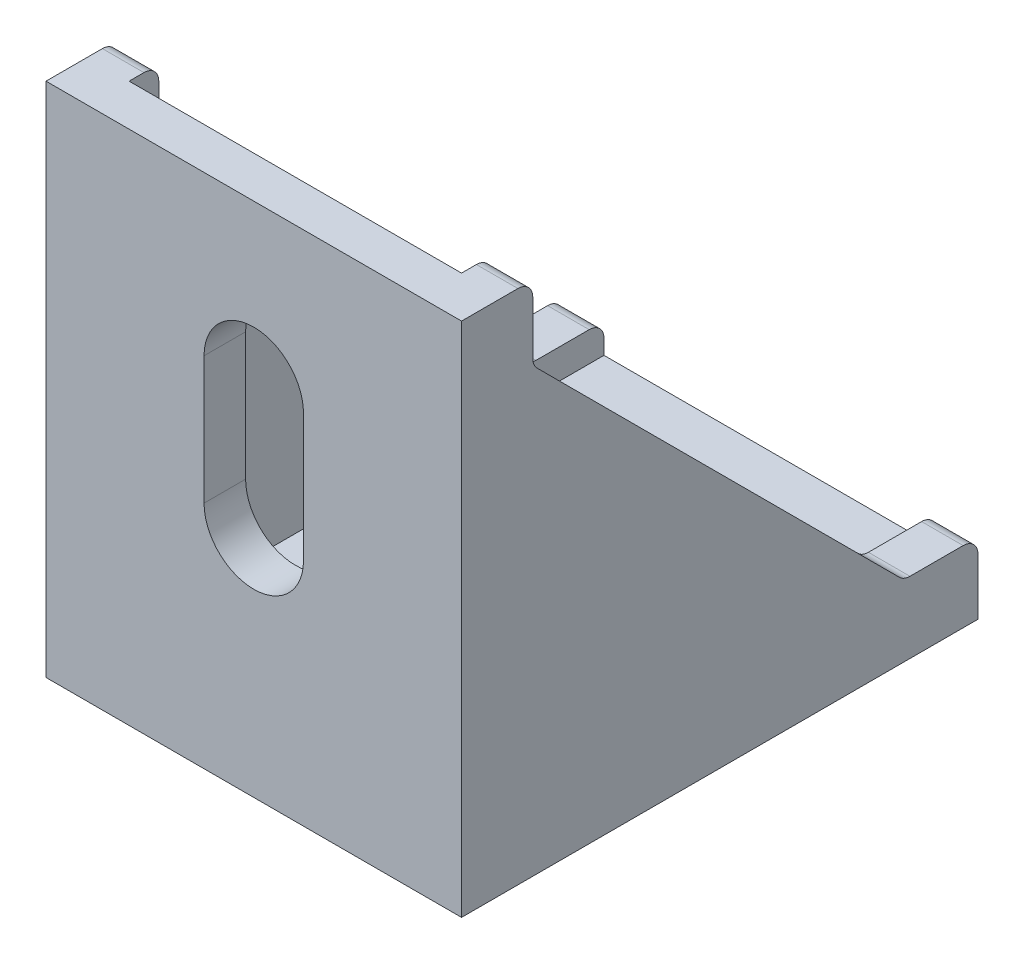
ISO-10303-21;
HEADER;
FILE_DESCRIPTION(('STEP AP214'),'2;1');
FILE_NAME('part.step','',(''),(''),'','','');
FILE_SCHEMA(('AUTOMOTIVE_DESIGN { 1 0 10303 214 1 1 1 1 }'));
ENDSEC;
DATA;
#1=APPLICATION_CONTEXT('core data for automotive mechanical design processes');
#2=APPLICATION_PROTOCOL_DEFINITION('international standard','automotive_design',2000,#1);
#3=PRODUCT_CONTEXT('',#1,'mechanical');
#4=PRODUCT('Part','Part','',(#3));
#5=PRODUCT_RELATED_PRODUCT_CATEGORY('part','',(#4));
#6=PRODUCT_DEFINITION_FORMATION('','',#4);
#7=PRODUCT_DEFINITION_CONTEXT('part definition',#1,'design');
#8=PRODUCT_DEFINITION('design','',#6,#7);
#9=PRODUCT_DEFINITION_SHAPE('','',#8);
#10=(LENGTH_UNIT() NAMED_UNIT(*) SI_UNIT(.MILLI.,.METRE.));
#11=(NAMED_UNIT(*) PLANE_ANGLE_UNIT() SI_UNIT($,.RADIAN.));
#12=(NAMED_UNIT(*) SI_UNIT($,.STERADIAN.) SOLID_ANGLE_UNIT());
#13=UNCERTAINTY_MEASURE_WITH_UNIT(LENGTH_MEASURE(1.E-05),#10,'distance_accuracy_value','');
#14=(GEOMETRIC_REPRESENTATION_CONTEXT(3) GLOBAL_UNCERTAINTY_ASSIGNED_CONTEXT((#13)) GLOBAL_UNIT_ASSIGNED_CONTEXT((#10,
#11,#12)) REPRESENTATION_CONTEXT('',''));
#15=CARTESIAN_POINT('',(0.,0.,0.));
#16=DIRECTION('',(0.,0.,1.));
#17=DIRECTION('',(1.,0.,0.));
#18=AXIS2_PLACEMENT_3D('',#15,#16,#17);
#19=CARTESIAN_POINT('',(-14.,34.8,-2.8));
#20=DIRECTION('',(0.,1.,0.));
#21=DIRECTION('',(0.,0.,1.));
#22=AXIS2_PLACEMENT_3D('',#19,#20,#21);
#23=PLANE('',#22);
#24=DIRECTION('',(0.,0.,1.));
#25=VECTOR('',#24,1.);
#26=CARTESIAN_POINT('',(-11.2,34.8,-2.8));
#27=LINE('',#26,#25);
#28=CARTESIAN_POINT('',(-11.2,34.8,-3.8));
#29=VERTEX_POINT('',#28);
#30=CARTESIAN_POINT('',(-11.2,34.8,-2.8));
#31=VERTEX_POINT('',#30);
#32=EDGE_CURVE('E302',#29,#31,#27,.T.);
#33=ORIENTED_EDGE('',*,*,#32,.F.);
#34=DIRECTION('',(-1.,0.,0.));
#35=VECTOR('',#34,1.);
#36=CARTESIAN_POINT('',(-14.,34.8,-3.8));
#37=LINE('',#36,#35);
#38=CARTESIAN_POINT('',(-14.,34.8,-3.8));
#39=VERTEX_POINT('',#38);
#40=EDGE_CURVE('E445',#29,#39,#37,.T.);
#41=ORIENTED_EDGE('',*,*,#40,.T.);
#42=DIRECTION('',(0.,0.,1.));
#43=VECTOR('',#42,1.);
#44=CARTESIAN_POINT('',(-14.,34.8,-2.8));
#45=LINE('',#44,#43);
#46=CARTESIAN_POINT('',(-14.,34.8,0.));
#47=VERTEX_POINT('',#46);
#48=EDGE_CURVE('E357',#39,#47,#45,.T.);
#49=ORIENTED_EDGE('',*,*,#48,.T.);
#50=DIRECTION('',(1.,0.,0.));
#51=VECTOR('',#50,1.);
#52=CARTESIAN_POINT('',(-14.,34.8,0.));
#53=LINE('',#52,#51);
#54=CARTESIAN_POINT('',(14.,34.8,0.));
#55=VERTEX_POINT('',#54);
#56=EDGE_CURVE('E369',#47,#55,#53,.T.);
#57=ORIENTED_EDGE('',*,*,#56,.T.);
#58=DIRECTION('',(0.,0.,1.));
#59=VECTOR('',#58,1.);
#60=CARTESIAN_POINT('',(14.,34.8,-2.8));
#61=LINE('',#60,#59);
#62=CARTESIAN_POINT('',(14.,34.8,-3.8));
#63=VERTEX_POINT('',#62);
#64=EDGE_CURVE('E349',#63,#55,#61,.T.);
#65=ORIENTED_EDGE('',*,*,#64,.F.);
#66=DIRECTION('',(1.,0.,0.));
#67=VECTOR('',#66,1.);
#68=CARTESIAN_POINT('',(-14.,34.8,-3.8));
#69=LINE('',#68,#67);
#70=CARTESIAN_POINT('',(11.2,34.8,-3.8));
#71=VERTEX_POINT('',#70);
#72=EDGE_CURVE('E443',#63,#71,#69,.F.);
#73=ORIENTED_EDGE('',*,*,#72,.T.);
#74=DIRECTION('',(0.,0.,1.));
#75=VECTOR('',#74,1.);
#76=CARTESIAN_POINT('',(11.2,34.8,-2.8));
#77=LINE('',#76,#75);
#78=CARTESIAN_POINT('',(11.2,34.8,-2.8));
#79=VERTEX_POINT('',#78);
#80=EDGE_CURVE('E347',#71,#79,#77,.T.);
#81=ORIENTED_EDGE('',*,*,#80,.T.);
#82=DIRECTION('',(1.,0.,0.));
#83=VECTOR('',#82,1.);
#84=CARTESIAN_POINT('',(-14.,34.8,-2.8));
#85=LINE('',#84,#83);
#86=EDGE_CURVE('E379',#31,#79,#85,.T.);
#87=ORIENTED_EDGE('',*,*,#86,.F.);
#88=EDGE_LOOP('',(#33,#41,#49,#57,#65,#73,#81,#87));
#89=FACE_BOUND('',#88,.T.);
#90=ADVANCED_FACE('F34',(#89),#23,.T.);
#91=CARTESIAN_POINT('',(-14.,2.8,-2.8));
#92=DIRECTION('',(0.,0.,-1.));
#93=DIRECTION('',(0.,1.,0.));
#94=AXIS2_PLACEMENT_3D('',#91,#92,#93);
#95=PLANE('',#94);
#96=CARTESIAN_POINT('',(0.,15.5,-2.8));
#97=DIRECTION('',(0.,0.,-1.));
#98=DIRECTION('',(0.,1.,0.));
#99=AXIS2_PLACEMENT_3D('',#96,#97,#98);
#100=CIRCLE('',#99,3.35);
#101=CARTESIAN_POINT('',(3.35,15.5,-2.8));
#102=VERTEX_POINT('',#101);
#103=CARTESIAN_POINT('',(-3.35,15.5,-2.8));
#104=VERTEX_POINT('',#103);
#105=EDGE_CURVE('E49',#102,#104,#100,.T.);
#106=ORIENTED_EDGE('',*,*,#105,.F.);
#107=DIRECTION('',(0.,-1.,0.));
#108=VECTOR('',#107,1.);
#109=CARTESIAN_POINT('',(3.35,15.5,-2.8));
#110=LINE('',#109,#108);
#111=CARTESIAN_POINT('',(3.35,24.1,-2.8));
#112=VERTEX_POINT('',#111);
#113=EDGE_CURVE('E248',#112,#102,#110,.T.);
#114=ORIENTED_EDGE('',*,*,#113,.F.);
#115=CARTESIAN_POINT('',(0.,24.1,-2.8));
#116=DIRECTION('',(0.,0.,-1.));
#117=DIRECTION('',(0.,1.,0.));
#118=AXIS2_PLACEMENT_3D('',#115,#116,#117);
#119=CIRCLE('',#118,3.35);
#120=CARTESIAN_POINT('',(-3.35,24.1,-2.8));
#121=VERTEX_POINT('',#120);
#122=EDGE_CURVE('E251',#121,#112,#119,.T.);
#123=ORIENTED_EDGE('',*,*,#122,.F.);
#124=DIRECTION('',(0.,1.,0.));
#125=VECTOR('',#124,1.);
#126=CARTESIAN_POINT('',(-3.35,15.5,-2.8));
#127=LINE('',#126,#125);
#128=EDGE_CURVE('E257',#104,#121,#127,.T.);
#129=ORIENTED_EDGE('',*,*,#128,.F.);
#130=EDGE_LOOP('',(#106,#114,#123,#129));
#131=FACE_BOUND('',#130,.T.);
#132=DIRECTION('',(0.,-1.,0.));
#133=VECTOR('',#132,1.);
#134=CARTESIAN_POINT('',(-11.2,2.8,-2.8));
#135=LINE('',#134,#133);
#136=CARTESIAN_POINT('',(-11.2,2.8,-2.8));
#137=VERTEX_POINT('',#136);
#138=EDGE_CURVE('E299',#31,#137,#135,.T.);
#139=ORIENTED_EDGE('',*,*,#138,.F.);
#140=ORIENTED_EDGE('',*,*,#86,.T.);
#141=DIRECTION('',(0.,-1.,0.));
#142=VECTOR('',#141,1.);
#143=CARTESIAN_POINT('',(11.2,2.8,-2.8));
#144=LINE('',#143,#142);
#145=CARTESIAN_POINT('',(11.2,2.8,-2.8));
#146=VERTEX_POINT('',#145);
#147=EDGE_CURVE('E328',#79,#146,#144,.T.);
#148=ORIENTED_EDGE('',*,*,#147,.T.);
#149=DIRECTION('',(1.,0.,0.));
#150=VECTOR('',#149,1.);
#151=CARTESIAN_POINT('',(-14.,2.8,-2.8));
#152=LINE('',#151,#150);
#153=EDGE_CURVE('E383',#137,#146,#152,.T.);
#154=ORIENTED_EDGE('',*,*,#153,.F.);
#155=EDGE_LOOP('',(#139,#140,#148,#154));
#156=FACE_BOUND('',#155,.T.);
#157=ADVANCED_FACE('F498',(#131,#156),#95,.T.);
#158=CARTESIAN_POINT('',(-14.,2.8,-34.8));
#159=DIRECTION('',(0.,1.,0.));
#160=DIRECTION('',(0.,0.,1.));
#161=AXIS2_PLACEMENT_3D('',#158,#159,#160);
#162=PLANE('',#161);
#163=CARTESIAN_POINT('',(0.,2.8,-15.5));
#164=DIRECTION('',(0.,1.,0.));
#165=DIRECTION('',(0.,0.,1.));
#166=AXIS2_PLACEMENT_3D('',#163,#164,#165);
#167=CIRCLE('',#166,3.35);
#168=CARTESIAN_POINT('',(-3.35,2.8,-15.5));
#169=VERTEX_POINT('',#168);
#170=CARTESIAN_POINT('',(3.35,2.8,-15.5));
#171=VERTEX_POINT('',#170);
#172=EDGE_CURVE('E263',#169,#171,#167,.T.);
#173=ORIENTED_EDGE('',*,*,#172,.F.);
#174=DIRECTION('',(0.,0.,1.));
#175=VECTOR('',#174,1.);
#176=CARTESIAN_POINT('',(-3.35,2.8,-15.5));
#177=LINE('',#176,#175);
#178=CARTESIAN_POINT('',(-3.35,2.8,-24.1));
#179=VERTEX_POINT('',#178);
#180=EDGE_CURVE('E271',#179,#169,#177,.T.);
#181=ORIENTED_EDGE('',*,*,#180,.F.);
#182=CARTESIAN_POINT('',(0.,2.8,-24.1));
#183=DIRECTION('',(0.,1.,0.));
#184=DIRECTION('',(0.,0.,1.));
#185=AXIS2_PLACEMENT_3D('',#182,#183,#184);
#186=CIRCLE('',#185,3.35);
#187=CARTESIAN_POINT('',(3.35,2.8,-24.1));
#188=VERTEX_POINT('',#187);
#189=EDGE_CURVE('E285',#188,#179,#186,.T.);
#190=ORIENTED_EDGE('',*,*,#189,.F.);
#191=DIRECTION('',(0.,0.,-1.));
#192=VECTOR('',#191,1.);
#193=CARTESIAN_POINT('',(3.35,2.8,-15.5));
#194=LINE('',#193,#192);
#195=EDGE_CURVE('E282',#171,#188,#194,.T.);
#196=ORIENTED_EDGE('',*,*,#195,.F.);
#197=EDGE_LOOP('',(#173,#181,#190,#196));
#198=FACE_BOUND('',#197,.T.);
#199=DIRECTION('',(0.,0.,-1.));
#200=VECTOR('',#199,1.);
#201=CARTESIAN_POINT('',(-11.2,2.8,-34.8));
#202=LINE('',#201,#200);
#203=CARTESIAN_POINT('',(-11.2,2.8,-34.8));
#204=VERTEX_POINT('',#203);
#205=EDGE_CURVE('E317',#137,#204,#202,.T.);
#206=ORIENTED_EDGE('',*,*,#205,.F.);
#207=ORIENTED_EDGE('',*,*,#153,.T.);
#208=DIRECTION('',(0.,0.,-1.));
#209=VECTOR('',#208,1.);
#210=CARTESIAN_POINT('',(11.2,2.8,-34.8));
#211=LINE('',#210,#209);
#212=CARTESIAN_POINT('',(11.2,2.8,-34.8));
#213=VERTEX_POINT('',#212);
#214=EDGE_CURVE('E331',#146,#213,#211,.T.);
#215=ORIENTED_EDGE('',*,*,#214,.T.);
#216=DIRECTION('',(1.,0.,0.));
#217=VECTOR('',#216,1.);
#218=CARTESIAN_POINT('',(-14.,2.8,-34.8));
#219=LINE('',#218,#217);
#220=EDGE_CURVE('E385',#204,#213,#219,.T.);
#221=ORIENTED_EDGE('',*,*,#220,.F.);
#222=EDGE_LOOP('',(#206,#207,#215,#221));
#223=FACE_BOUND('',#222,.T.);
#224=ADVANCED_FACE('F489',(#198,#223),#162,.T.);
#225=CARTESIAN_POINT('',(-14.,0.,-34.8));
#226=DIRECTION('',(0.,0.,-1.));
#227=DIRECTION('',(-1.,0.,0.));
#228=AXIS2_PLACEMENT_3D('',#225,#226,#227);
#229=PLANE('',#228);
#230=DIRECTION('',(0.,1.,0.));
#231=VECTOR('',#230,1.);
#232=CARTESIAN_POINT('',(11.2,4.8,-34.8));
#233=LINE('',#232,#231);
#234=CARTESIAN_POINT('',(11.2,3.8,-34.8));
#235=VERTEX_POINT('',#234);
#236=EDGE_CURVE('E335',#213,#235,#233,.T.);
#237=ORIENTED_EDGE('',*,*,#236,.T.);
#238=DIRECTION('',(1.,0.,0.));
#239=VECTOR('',#238,1.);
#240=CARTESIAN_POINT('',(-14.,3.8,-34.8));
#241=LINE('',#240,#239);
#242=CARTESIAN_POINT('',(14.,3.8,-34.8));
#243=VERTEX_POINT('',#242);
#244=EDGE_CURVE('E424',#235,#243,#241,.T.);
#245=ORIENTED_EDGE('',*,*,#244,.T.);
#246=DIRECTION('',(0.,1.,0.));
#247=VECTOR('',#246,1.);
#248=CARTESIAN_POINT('',(14.,0.,-34.8));
#249=LINE('',#248,#247);
#250=CARTESIAN_POINT('',(14.,0.,-34.8));
#251=VERTEX_POINT('',#250);
#252=EDGE_CURVE('E360',#251,#243,#249,.T.);
#253=ORIENTED_EDGE('',*,*,#252,.F.);
#254=DIRECTION('',(1.,0.,0.));
#255=VECTOR('',#254,1.);
#256=CARTESIAN_POINT('',(-14.,0.,-34.8));
#257=LINE('',#256,#255);
#258=CARTESIAN_POINT('',(-14.,0.,-34.8));
#259=VERTEX_POINT('',#258);
#260=EDGE_CURVE('E387',#259,#251,#257,.T.);
#261=ORIENTED_EDGE('',*,*,#260,.F.);
#262=DIRECTION('',(0.,1.,0.));
#263=VECTOR('',#262,1.);
#264=CARTESIAN_POINT('',(-14.,0.,-34.8));
#265=LINE('',#264,#263);
#266=CARTESIAN_POINT('',(-14.,3.8,-34.8));
#267=VERTEX_POINT('',#266);
#268=EDGE_CURVE('E366',#259,#267,#265,.T.);
#269=ORIENTED_EDGE('',*,*,#268,.T.);
#270=DIRECTION('',(-1.,0.,0.));
#271=VECTOR('',#270,1.);
#272=CARTESIAN_POINT('',(-11.2,3.8,-34.8));
#273=LINE('',#272,#271);
#274=CARTESIAN_POINT('',(-11.2,3.8,-34.8));
#275=VERTEX_POINT('',#274);
#276=EDGE_CURVE('E422',#267,#275,#273,.F.);
#277=ORIENTED_EDGE('',*,*,#276,.T.);
#278=DIRECTION('',(0.,1.,0.));
#279=VECTOR('',#278,1.);
#280=CARTESIAN_POINT('',(-11.2,4.8,-34.8));
#281=LINE('',#280,#279);
#282=EDGE_CURVE('E314',#204,#275,#281,.T.);
#283=ORIENTED_EDGE('',*,*,#282,.F.);
#284=ORIENTED_EDGE('',*,*,#220,.T.);
#285=EDGE_LOOP('',(#237,#245,#253,#261,#269,#277,#283,#284));
#286=FACE_BOUND('',#285,.T.);
#287=ADVANCED_FACE('F485',(#286),#229,.T.);
#288=CARTESIAN_POINT('',(-14.,0.,0.));
#289=DIRECTION('',(0.,-1.,0.));
#290=DIRECTION('',(0.,0.,-1.));
#291=AXIS2_PLACEMENT_3D('',#288,#289,#290);
#292=PLANE('',#291);
#293=CARTESIAN_POINT('',(0.,0.,-15.5));
#294=DIRECTION('',(0.,1.,0.));
#295=DIRECTION('',(0.,0.,1.));
#296=AXIS2_PLACEMENT_3D('',#293,#294,#295);
#297=CIRCLE('',#296,3.35);
#298=CARTESIAN_POINT('',(-3.35,0.,-15.5));
#299=VERTEX_POINT('',#298);
#300=CARTESIAN_POINT('',(3.35,0.,-15.5));
#301=VERTEX_POINT('',#300);
#302=EDGE_CURVE('E267',#299,#301,#297,.T.);
#303=ORIENTED_EDGE('',*,*,#302,.T.);
#304=DIRECTION('',(0.,0.,-1.));
#305=VECTOR('',#304,1.);
#306=CARTESIAN_POINT('',(3.35,0.,-15.5));
#307=LINE('',#306,#305);
#308=CARTESIAN_POINT('',(3.35,0.,-24.1));
#309=VERTEX_POINT('',#308);
#310=EDGE_CURVE('E270',#301,#309,#307,.T.);
#311=ORIENTED_EDGE('',*,*,#310,.T.);
#312=CARTESIAN_POINT('',(0.,0.,-24.1));
#313=DIRECTION('',(0.,1.,0.));
#314=DIRECTION('',(0.,0.,1.));
#315=AXIS2_PLACEMENT_3D('',#312,#313,#314);
#316=CIRCLE('',#315,3.35);
#317=CARTESIAN_POINT('',(-3.35,0.,-24.1));
#318=VERTEX_POINT('',#317);
#319=EDGE_CURVE('E274',#309,#318,#316,.T.);
#320=ORIENTED_EDGE('',*,*,#319,.T.);
#321=DIRECTION('',(0.,0.,1.));
#322=VECTOR('',#321,1.);
#323=CARTESIAN_POINT('',(-3.35,0.,-15.5));
#324=LINE('',#323,#322);
#325=EDGE_CURVE('E277',#318,#299,#324,.T.);
#326=ORIENTED_EDGE('',*,*,#325,.T.);
#327=EDGE_LOOP('',(#303,#311,#320,#326));
#328=FACE_BOUND('',#327,.T.);
#329=DIRECTION('',(0.,0.,-1.));
#330=VECTOR('',#329,1.);
#331=CARTESIAN_POINT('',(14.,0.,0.));
#332=LINE('',#331,#330);
#333=CARTESIAN_POINT('',(14.,0.,0.));
#334=VERTEX_POINT('',#333);
#335=EDGE_CURVE('E374',#334,#251,#332,.T.);
#336=ORIENTED_EDGE('',*,*,#335,.F.);
#337=DIRECTION('',(1.,0.,0.));
#338=VECTOR('',#337,1.);
#339=CARTESIAN_POINT('',(-14.,0.,0.));
#340=LINE('',#339,#338);
#341=CARTESIAN_POINT('',(-14.,0.,0.));
#342=VERTEX_POINT('',#341);
#343=EDGE_CURVE('E389',#342,#334,#340,.T.);
#344=ORIENTED_EDGE('',*,*,#343,.F.);
#345=DIRECTION('',(0.,0.,-1.));
#346=VECTOR('',#345,1.);
#347=CARTESIAN_POINT('',(-14.,0.,0.));
#348=LINE('',#347,#346);
#349=EDGE_CURVE('E363',#342,#259,#348,.T.);
#350=ORIENTED_EDGE('',*,*,#349,.T.);
#351=ORIENTED_EDGE('',*,*,#260,.T.);
#352=EDGE_LOOP('',(#336,#344,#350,#351));
#353=FACE_BOUND('',#352,.T.);
#354=ADVANCED_FACE('F539',(#328,#353),#292,.T.);
#355=CARTESIAN_POINT('',(-14.,34.8,0.));
#356=DIRECTION('',(0.,0.,1.));
#357=DIRECTION('',(0.,-1.,0.));
#358=AXIS2_PLACEMENT_3D('',#355,#356,#357);
#359=PLANE('',#358);
#360=CARTESIAN_POINT('',(0.,15.5,0.));
#361=DIRECTION('',(0.,0.,-1.));
#362=DIRECTION('',(0.,1.,0.));
#363=AXIS2_PLACEMENT_3D('',#360,#361,#362);
#364=CIRCLE('',#363,3.35);
#365=CARTESIAN_POINT('',(3.35,15.5,0.));
#366=VERTEX_POINT('',#365);
#367=CARTESIAN_POINT('',(-3.35,15.5,0.));
#368=VERTEX_POINT('',#367);
#369=EDGE_CURVE('E232',#366,#368,#364,.T.);
#370=ORIENTED_EDGE('',*,*,#369,.T.);
#371=DIRECTION('',(0.,1.,0.));
#372=VECTOR('',#371,1.);
#373=CARTESIAN_POINT('',(-3.35,15.5,0.));
#374=LINE('',#373,#372);
#375=CARTESIAN_POINT('',(-3.35,24.1,0.));
#376=VERTEX_POINT('',#375);
#377=EDGE_CURVE('E241',#368,#376,#374,.T.);
#378=ORIENTED_EDGE('',*,*,#377,.T.);
#379=CARTESIAN_POINT('',(0.,24.1,0.));
#380=DIRECTION('',(0.,0.,-1.));
#381=DIRECTION('',(0.,1.,0.));
#382=AXIS2_PLACEMENT_3D('',#379,#380,#381);
#383=CIRCLE('',#382,3.35);
#384=CARTESIAN_POINT('',(3.35,24.1,0.));
#385=VERTEX_POINT('',#384);
#386=EDGE_CURVE('E57',#376,#385,#383,.T.);
#387=ORIENTED_EDGE('',*,*,#386,.T.);
#388=DIRECTION('',(0.,-1.,0.));
#389=VECTOR('',#388,1.);
#390=CARTESIAN_POINT('',(3.35,15.5,0.));
#391=LINE('',#390,#389);
#392=EDGE_CURVE('E238',#385,#366,#391,.T.);
#393=ORIENTED_EDGE('',*,*,#392,.T.);
#394=EDGE_LOOP('',(#370,#378,#387,#393));
#395=FACE_BOUND('',#394,.T.);
#396=DIRECTION('',(0.,-1.,0.));
#397=VECTOR('',#396,1.);
#398=CARTESIAN_POINT('',(14.,34.8,0.));
#399=LINE('',#398,#397);
#400=EDGE_CURVE('E371',#55,#334,#399,.T.);
#401=ORIENTED_EDGE('',*,*,#400,.F.);
#402=ORIENTED_EDGE('',*,*,#56,.F.);
#403=DIRECTION('',(0.,-1.,0.));
#404=VECTOR('',#403,1.);
#405=CARTESIAN_POINT('',(-14.,34.8,0.));
#406=LINE('',#405,#404);
#407=EDGE_CURVE('E359',#47,#342,#406,.T.);
#408=ORIENTED_EDGE('',*,*,#407,.T.);
#409=ORIENTED_EDGE('',*,*,#343,.T.);
#410=EDGE_LOOP('',(#401,#402,#408,#409));
#411=FACE_BOUND('',#410,.T.);
#412=ADVANCED_FACE('F245',(#395,#411),#359,.T.);
#413=CARTESIAN_POINT('',(-14.,0.,0.));
#414=DIRECTION('',(1.,0.,0.));
#415=DIRECTION('',(0.,0.,-1.));
#416=AXIS2_PLACEMENT_3D('',#413,#414,#415);
#417=PLANE('',#416);
#418=DIRECTION('',(0.,0.,1.));
#419=VECTOR('',#418,1.);
#420=CARTESIAN_POINT('',(-14.,4.8,-29.8));
#421=LINE('',#420,#419);
#422=CARTESIAN_POINT('',(-14.,4.8,-33.8));
#423=VERTEX_POINT('',#422);
#424=CARTESIAN_POINT('',(-14.,4.8,-30.2142135623731));
#425=VERTEX_POINT('',#424);
#426=EDGE_CURVE('E303',#423,#425,#421,.T.);
#427=ORIENTED_EDGE('',*,*,#426,.F.);
#428=CARTESIAN_POINT('',(-14.,3.8,-33.8));
#429=DIRECTION('',(1.,0.,0.));
#430=DIRECTION('',(0.,0.,-1.));
#431=AXIS2_PLACEMENT_3D('',#428,#429,#430);
#432=CIRCLE('',#431,1.);
#433=EDGE_CURVE('E437',#423,#267,#432,.F.);
#434=ORIENTED_EDGE('',*,*,#433,.T.);
#435=ORIENTED_EDGE('',*,*,#268,.F.);
#436=ORIENTED_EDGE('',*,*,#349,.F.);
#437=ORIENTED_EDGE('',*,*,#407,.F.);
#438=ORIENTED_EDGE('',*,*,#48,.F.);
#439=CARTESIAN_POINT('',(-14.,33.8,-3.8));
#440=DIRECTION('',(1.,0.,0.));
#441=DIRECTION('',(0.,0.,-1.));
#442=AXIS2_PLACEMENT_3D('',#439,#440,#441);
#443=CIRCLE('',#442,1.);
#444=CARTESIAN_POINT('',(-14.,33.8,-4.8));
#445=VERTEX_POINT('',#444);
#446=EDGE_CURVE('E435',#39,#445,#443,.F.);
#447=ORIENTED_EDGE('',*,*,#446,.T.);
#448=DIRECTION('',(0.,1.,0.));
#449=VECTOR('',#448,1.);
#450=CARTESIAN_POINT('',(-14.,34.8,-4.8));
#451=LINE('',#450,#449);
#452=CARTESIAN_POINT('',(-14.,30.2142135623731,-4.8));
#453=VERTEX_POINT('',#452);
#454=EDGE_CURVE('E292',#453,#445,#451,.T.);
#455=ORIENTED_EDGE('',*,*,#454,.F.);
#456=CARTESIAN_POINT('',(-14.,30.2142135623731,-5.8));
#457=DIRECTION('',(1.,0.,0.));
#458=DIRECTION('',(0.,0.,-1.));
#459=AXIS2_PLACEMENT_3D('',#456,#457,#458);
#460=CIRCLE('',#459,1.);
#461=CARTESIAN_POINT('',(-14.,29.5071067811865,-5.09289321881345));
#462=VERTEX_POINT('',#461);
#463=EDGE_CURVE('E452',#453,#462,#460,.T.);
#464=ORIENTED_EDGE('',*,*,#463,.T.);
#465=DIRECTION('',(0.,0.707106781186547,0.707106781186547));
#466=VECTOR('',#465,1.);
#467=CARTESIAN_POINT('',(-14.,29.8,-4.8));
#468=LINE('',#467,#466);
#469=CARTESIAN_POINT('',(-14.,5.09289321881346,-29.5071067811865));
#470=VERTEX_POINT('',#469);
#471=EDGE_CURVE('E323',#470,#462,#468,.T.);
#472=ORIENTED_EDGE('',*,*,#471,.F.);
#473=CARTESIAN_POINT('',(-14.,5.8,-30.2142135623731));
#474=DIRECTION('',(1.,0.,0.));
#475=DIRECTION('',(0.,0.,-1.));
#476=AXIS2_PLACEMENT_3D('',#473,#474,#475);
#477=CIRCLE('',#476,1.);
#478=EDGE_CURVE('E456',#470,#425,#477,.T.);
#479=ORIENTED_EDGE('',*,*,#478,.T.);
#480=EDGE_LOOP('',(#427,#434,#435,#436,#437,#438,#447,#455,#464,#472,#479));
#481=FACE_BOUND('',#480,.T.);
#482=ADVANCED_FACE('F538',(#481),#417,.F.);
#483=CARTESIAN_POINT('',(14.,0.,0.));
#484=DIRECTION('',(1.,0.,0.));
#485=DIRECTION('',(0.,0.,-1.));
#486=AXIS2_PLACEMENT_3D('',#483,#484,#485);
#487=PLANE('',#486);
#488=ORIENTED_EDGE('',*,*,#252,.T.);
#489=CARTESIAN_POINT('',(14.,3.8,-33.8));
#490=DIRECTION('',(1.,0.,0.));
#491=DIRECTION('',(0.,0.,-1.));
#492=AXIS2_PLACEMENT_3D('',#489,#490,#491);
#493=CIRCLE('',#492,1.);
#494=CARTESIAN_POINT('',(14.,4.8,-33.8));
#495=VERTEX_POINT('',#494);
#496=EDGE_CURVE('E429',#243,#495,#493,.T.);
#497=ORIENTED_EDGE('',*,*,#496,.T.);
#498=DIRECTION('',(0.,0.,1.));
#499=VECTOR('',#498,1.);
#500=CARTESIAN_POINT('',(14.,4.8,-29.8));
#501=LINE('',#500,#499);
#502=CARTESIAN_POINT('',(14.,4.8,-30.2142135623731));
#503=VERTEX_POINT('',#502);
#504=EDGE_CURVE('E320',#495,#503,#501,.T.);
#505=ORIENTED_EDGE('',*,*,#504,.T.);
#506=CARTESIAN_POINT('',(14.,5.8,-30.2142135623731));
#507=DIRECTION('',(1.,0.,0.));
#508=DIRECTION('',(0.,0.,-1.));
#509=AXIS2_PLACEMENT_3D('',#506,#507,#508);
#510=CIRCLE('',#509,1.);
#511=CARTESIAN_POINT('',(14.,5.09289321881346,-29.5071067811865));
#512=VERTEX_POINT('',#511);
#513=EDGE_CURVE('E42',#503,#512,#510,.F.);
#514=ORIENTED_EDGE('',*,*,#513,.T.);
#515=DIRECTION('',(0.,0.707106781186547,0.707106781186547));
#516=VECTOR('',#515,1.);
#517=CARTESIAN_POINT('',(14.,29.8,-4.8));
#518=LINE('',#517,#516);
#519=CARTESIAN_POINT('',(14.,29.5071067811865,-5.09289321881345));
#520=VERTEX_POINT('',#519);
#521=EDGE_CURVE('E352',#512,#520,#518,.T.);
#522=ORIENTED_EDGE('',*,*,#521,.T.);
#523=CARTESIAN_POINT('',(14.,30.2142135623731,-5.8));
#524=DIRECTION('',(1.,0.,0.));
#525=DIRECTION('',(0.,0.,-1.));
#526=AXIS2_PLACEMENT_3D('',#523,#524,#525);
#527=CIRCLE('',#526,1.);
#528=CARTESIAN_POINT('',(14.,30.2142135623731,-4.8));
#529=VERTEX_POINT('',#528);
#530=EDGE_CURVE('E448',#520,#529,#527,.F.);
#531=ORIENTED_EDGE('',*,*,#530,.T.);
#532=DIRECTION('',(0.,1.,0.));
#533=VECTOR('',#532,1.);
#534=CARTESIAN_POINT('',(14.,34.8,-4.8));
#535=LINE('',#534,#533);
#536=CARTESIAN_POINT('',(14.,33.8,-4.8));
#537=VERTEX_POINT('',#536);
#538=EDGE_CURVE('E332',#529,#537,#535,.T.);
#539=ORIENTED_EDGE('',*,*,#538,.T.);
#540=CARTESIAN_POINT('',(14.,33.8,-3.8));
#541=DIRECTION('',(1.,0.,0.));
#542=DIRECTION('',(0.,0.,-1.));
#543=AXIS2_PLACEMENT_3D('',#540,#541,#542);
#544=CIRCLE('',#543,1.);
#545=EDGE_CURVE('E427',#537,#63,#544,.T.);
#546=ORIENTED_EDGE('',*,*,#545,.T.);
#547=ORIENTED_EDGE('',*,*,#64,.T.);
#548=ORIENTED_EDGE('',*,*,#400,.T.);
#549=ORIENTED_EDGE('',*,*,#335,.T.);
#550=EDGE_LOOP('',(#488,#497,#505,#514,#522,#531,#539,#546,#547,#548,#549));
#551=FACE_BOUND('',#550,.T.);
#552=ADVANCED_FACE('F461',(#551),#487,.T.);
#553=CARTESIAN_POINT('',(11.2,34.8,-4.8));
#554=DIRECTION('',(0.,0.,-1.));
#555=DIRECTION('',(-1.,0.,0.));
#556=AXIS2_PLACEMENT_3D('',#553,#554,#555);
#557=PLANE('',#556);
#558=ORIENTED_EDGE('',*,*,#538,.F.);
#559=DIRECTION('',(1.,0.,0.));
#560=VECTOR('',#559,1.);
#561=CARTESIAN_POINT('',(11.2,30.2142135623731,-4.8));
#562=LINE('',#561,#560);
#563=CARTESIAN_POINT('',(11.2,30.2142135623731,-4.8));
#564=VERTEX_POINT('',#563);
#565=EDGE_CURVE('E400',#529,#564,#562,.F.);
#566=ORIENTED_EDGE('',*,*,#565,.T.);
#567=DIRECTION('',(0.,1.,0.));
#568=VECTOR('',#567,1.);
#569=CARTESIAN_POINT('',(11.2,34.8,-4.8));
#570=LINE('',#569,#568);
#571=CARTESIAN_POINT('',(11.2,33.8,-4.8));
#572=VERTEX_POINT('',#571);
#573=EDGE_CURVE('E344',#564,#572,#570,.T.);
#574=ORIENTED_EDGE('',*,*,#573,.T.);
#575=DIRECTION('',(1.,0.,0.));
#576=VECTOR('',#575,1.);
#577=CARTESIAN_POINT('',(11.2,33.8,-4.8));
#578=LINE('',#577,#576);
#579=EDGE_CURVE('E397',#572,#537,#578,.T.);
#580=ORIENTED_EDGE('',*,*,#579,.T.);
#581=EDGE_LOOP('',(#558,#566,#574,#580));
#582=FACE_BOUND('',#581,.T.);
#583=ADVANCED_FACE('F511',(#582),#557,.T.);
#584=CARTESIAN_POINT('',(11.2,29.8,-4.8));
#585=DIRECTION('',(0.,0.707106781186548,-0.707106781186548));
#586=DIRECTION('',(0.,0.707106781186548,0.707106781186548));
#587=AXIS2_PLACEMENT_3D('',#584,#585,#586);
#588=PLANE('',#587);
#589=DIRECTION('',(0.,0.707106781186547,0.707106781186547));
#590=VECTOR('',#589,1.);
#591=CARTESIAN_POINT('',(11.2,29.8,-4.8));
#592=LINE('',#591,#590);
#593=CARTESIAN_POINT('',(11.2,5.09289321881346,-29.5071067811865));
#594=VERTEX_POINT('',#593);
#595=CARTESIAN_POINT('',(11.2,29.5071067811865,-5.09289321881345));
#596=VERTEX_POINT('',#595);
#597=EDGE_CURVE('E341',#594,#596,#592,.T.);
#598=ORIENTED_EDGE('',*,*,#597,.T.);
#599=DIRECTION('',(1.,0.,0.));
#600=VECTOR('',#599,1.);
#601=CARTESIAN_POINT('',(14.,29.5071067811865,-5.09289321881345));
#602=LINE('',#601,#600);
#603=EDGE_CURVE('E394',#596,#520,#602,.T.);
#604=ORIENTED_EDGE('',*,*,#603,.T.);
#605=ORIENTED_EDGE('',*,*,#521,.F.);
#606=DIRECTION('',(1.,0.,0.));
#607=VECTOR('',#606,1.);
#608=CARTESIAN_POINT('',(11.2,5.09289321881345,-29.5071067811865));
#609=LINE('',#608,#607);
#610=EDGE_CURVE('E382',#512,#594,#609,.F.);
#611=ORIENTED_EDGE('',*,*,#610,.T.);
#612=EDGE_LOOP('',(#598,#604,#605,#611));
#613=FACE_BOUND('',#612,.T.);
#614=ADVANCED_FACE('F467',(#613),#588,.T.);
#615=CARTESIAN_POINT('',(11.2,4.8,-29.8));
#616=DIRECTION('',(0.,1.,0.));
#617=DIRECTION('',(0.,0.,1.));
#618=AXIS2_PLACEMENT_3D('',#615,#616,#617);
#619=PLANE('',#618);
#620=DIRECTION('',(0.,0.,1.));
#621=VECTOR('',#620,1.);
#622=CARTESIAN_POINT('',(11.2,4.8,-29.8));
#623=LINE('',#622,#621);
#624=CARTESIAN_POINT('',(11.2,4.8,-33.8));
#625=VERTEX_POINT('',#624);
#626=CARTESIAN_POINT('',(11.2,4.8,-30.2142135623731));
#627=VERTEX_POINT('',#626);
#628=EDGE_CURVE('E338',#625,#627,#623,.T.);
#629=ORIENTED_EDGE('',*,*,#628,.T.);
#630=DIRECTION('',(1.,0.,0.));
#631=VECTOR('',#630,1.);
#632=CARTESIAN_POINT('',(14.,4.8,-30.2142135623731));
#633=LINE('',#632,#631);
#634=EDGE_CURVE('E419',#627,#503,#633,.T.);
#635=ORIENTED_EDGE('',*,*,#634,.T.);
#636=ORIENTED_EDGE('',*,*,#504,.F.);
#637=DIRECTION('',(1.,0.,0.));
#638=VECTOR('',#637,1.);
#639=CARTESIAN_POINT('',(11.2,4.8,-33.8));
#640=LINE('',#639,#638);
#641=EDGE_CURVE('E417',#495,#625,#640,.F.);
#642=ORIENTED_EDGE('',*,*,#641,.T.);
#643=EDGE_LOOP('',(#629,#635,#636,#642));
#644=FACE_BOUND('',#643,.T.);
#645=ADVANCED_FACE('F477',(#644),#619,.T.);
#646=CARTESIAN_POINT('',(11.2,0.,0.));
#647=DIRECTION('',(-1.,0.,0.));
#648=DIRECTION('',(0.,0.,1.));
#649=AXIS2_PLACEMENT_3D('',#646,#647,#648);
#650=PLANE('',#649);
#651=ORIENTED_EDGE('',*,*,#628,.F.);
#652=CARTESIAN_POINT('',(11.2,3.8,-33.8));
#653=DIRECTION('',(-1.,0.,0.));
#654=DIRECTION('',(0.,0.,1.));
#655=AXIS2_PLACEMENT_3D('',#652,#653,#654);
#656=CIRCLE('',#655,1.);
#657=EDGE_CURVE('E433',#625,#235,#656,.T.);
#658=ORIENTED_EDGE('',*,*,#657,.T.);
#659=ORIENTED_EDGE('',*,*,#236,.F.);
#660=ORIENTED_EDGE('',*,*,#214,.F.);
#661=ORIENTED_EDGE('',*,*,#147,.F.);
#662=ORIENTED_EDGE('',*,*,#80,.F.);
#663=CARTESIAN_POINT('',(11.2,33.8,-3.8));
#664=DIRECTION('',(-1.,0.,0.));
#665=DIRECTION('',(0.,0.,1.));
#666=AXIS2_PLACEMENT_3D('',#663,#664,#665);
#667=CIRCLE('',#666,1.);
#668=EDGE_CURVE('E431',#71,#572,#667,.T.);
#669=ORIENTED_EDGE('',*,*,#668,.T.);
#670=ORIENTED_EDGE('',*,*,#573,.F.);
#671=CARTESIAN_POINT('',(11.2,30.2142135623731,-5.8));
#672=DIRECTION('',(-1.,0.,0.));
#673=DIRECTION('',(0.,0.,1.));
#674=AXIS2_PLACEMENT_3D('',#671,#672,#673);
#675=CIRCLE('',#674,1.);
#676=EDGE_CURVE('E450',#564,#596,#675,.F.);
#677=ORIENTED_EDGE('',*,*,#676,.T.);
#678=ORIENTED_EDGE('',*,*,#597,.F.);
#679=CARTESIAN_POINT('',(11.2,5.8,-30.2142135623731));
#680=DIRECTION('',(-1.,0.,0.));
#681=DIRECTION('',(0.,0.,1.));
#682=AXIS2_PLACEMENT_3D('',#679,#680,#681);
#683=CIRCLE('',#682,1.);
#684=EDGE_CURVE('E11',#594,#627,#683,.F.);
#685=ORIENTED_EDGE('',*,*,#684,.T.);
#686=EDGE_LOOP('',(#651,#658,#659,#660,#661,#662,#669,#670,#677,#678,#685));
#687=FACE_BOUND('',#686,.T.);
#688=ADVANCED_FACE('F474',(#687),#650,.T.);
#689=CARTESIAN_POINT('',(-11.2,4.8,-29.8));
#690=DIRECTION('',(0.,-1.,0.));
#691=DIRECTION('',(0.,0.,-1.));
#692=AXIS2_PLACEMENT_3D('',#689,#690,#691);
#693=PLANE('',#692);
#694=ORIENTED_EDGE('',*,*,#426,.T.);
#695=DIRECTION('',(-1.,0.,0.));
#696=VECTOR('',#695,1.);
#697=CARTESIAN_POINT('',(-11.2,4.8,-30.2142135623731));
#698=LINE('',#697,#696);
#699=CARTESIAN_POINT('',(-11.2,4.8,-30.2142135623731));
#700=VERTEX_POINT('',#699);
#701=EDGE_CURVE('E415',#425,#700,#698,.F.);
#702=ORIENTED_EDGE('',*,*,#701,.T.);
#703=DIRECTION('',(0.,0.,1.));
#704=VECTOR('',#703,1.);
#705=CARTESIAN_POINT('',(-11.2,4.8,-29.8));
#706=LINE('',#705,#704);
#707=CARTESIAN_POINT('',(-11.2,4.8,-33.8));
#708=VERTEX_POINT('',#707);
#709=EDGE_CURVE('E311',#708,#700,#706,.T.);
#710=ORIENTED_EDGE('',*,*,#709,.F.);
#711=DIRECTION('',(-1.,0.,0.));
#712=VECTOR('',#711,1.);
#713=CARTESIAN_POINT('',(-14.,4.8,-33.8));
#714=LINE('',#713,#712);
#715=EDGE_CURVE('E412',#708,#423,#714,.T.);
#716=ORIENTED_EDGE('',*,*,#715,.T.);
#717=EDGE_LOOP('',(#694,#702,#710,#716));
#718=FACE_BOUND('',#717,.T.);
#719=ADVANCED_FACE('F561',(#718),#693,.F.);
#720=CARTESIAN_POINT('',(-11.2,29.8,-4.8));
#721=DIRECTION('',(0.,-0.707106781186548,0.707106781186548));
#722=DIRECTION('',(0.,-0.707106781186548,-0.707106781186548));
#723=AXIS2_PLACEMENT_3D('',#720,#721,#722);
#724=PLANE('',#723);
#725=ORIENTED_EDGE('',*,*,#471,.T.);
#726=DIRECTION('',(-1.,0.,0.));
#727=VECTOR('',#726,1.);
#728=CARTESIAN_POINT('',(-11.2,29.5071067811865,-5.09289321881345));
#729=LINE('',#728,#727);
#730=CARTESIAN_POINT('',(-11.2,29.5071067811865,-5.09289321881345));
#731=VERTEX_POINT('',#730);
#732=EDGE_CURVE('E410',#462,#731,#729,.F.);
#733=ORIENTED_EDGE('',*,*,#732,.T.);
#734=DIRECTION('',(0.,0.707106781186547,0.707106781186547));
#735=VECTOR('',#734,1.);
#736=CARTESIAN_POINT('',(-11.2,29.8,-4.8));
#737=LINE('',#736,#735);
#738=CARTESIAN_POINT('',(-11.2,5.09289321881346,-29.5071067811865));
#739=VERTEX_POINT('',#738);
#740=EDGE_CURVE('E308',#739,#731,#737,.T.);
#741=ORIENTED_EDGE('',*,*,#740,.F.);
#742=DIRECTION('',(-1.,0.,0.));
#743=VECTOR('',#742,1.);
#744=CARTESIAN_POINT('',(-14.,5.09289321881345,-29.5071067811865));
#745=LINE('',#744,#743);
#746=EDGE_CURVE('E407',#739,#470,#745,.T.);
#747=ORIENTED_EDGE('',*,*,#746,.T.);
#748=EDGE_LOOP('',(#725,#733,#741,#747));
#749=FACE_BOUND('',#748,.T.);
#750=ADVANCED_FACE('F564',(#749),#724,.F.);
#751=CARTESIAN_POINT('',(-11.2,34.8,-4.8));
#752=DIRECTION('',(0.,0.,1.));
#753=DIRECTION('',(1.,0.,0.));
#754=AXIS2_PLACEMENT_3D('',#751,#752,#753);
#755=PLANE('',#754);
#756=DIRECTION('',(0.,1.,0.));
#757=VECTOR('',#756,1.);
#758=CARTESIAN_POINT('',(-11.2,34.8,-4.8));
#759=LINE('',#758,#757);
#760=CARTESIAN_POINT('',(-11.2,30.2142135623731,-4.8));
#761=VERTEX_POINT('',#760);
#762=CARTESIAN_POINT('',(-11.2,33.8,-4.8));
#763=VERTEX_POINT('',#762);
#764=EDGE_CURVE('E305',#761,#763,#759,.T.);
#765=ORIENTED_EDGE('',*,*,#764,.F.);
#766=DIRECTION('',(-1.,0.,0.));
#767=VECTOR('',#766,1.);
#768=CARTESIAN_POINT('',(-14.,30.2142135623731,-4.8));
#769=LINE('',#768,#767);
#770=EDGE_CURVE('E404',#761,#453,#769,.T.);
#771=ORIENTED_EDGE('',*,*,#770,.T.);
#772=ORIENTED_EDGE('',*,*,#454,.T.);
#773=DIRECTION('',(-1.,0.,0.));
#774=VECTOR('',#773,1.);
#775=CARTESIAN_POINT('',(-11.2,33.8,-4.8));
#776=LINE('',#775,#774);
#777=EDGE_CURVE('E402',#445,#763,#776,.F.);
#778=ORIENTED_EDGE('',*,*,#777,.T.);
#779=EDGE_LOOP('',(#765,#771,#772,#778));
#780=FACE_BOUND('',#779,.T.);
#781=ADVANCED_FACE('F526',(#780),#755,.F.);
#782=CARTESIAN_POINT('',(-11.2,0.,0.));
#783=DIRECTION('',(1.,0.,0.));
#784=DIRECTION('',(0.,0.,1.));
#785=AXIS2_PLACEMENT_3D('',#782,#783,#784);
#786=PLANE('',#785);
#787=ORIENTED_EDGE('',*,*,#282,.T.);
#788=CARTESIAN_POINT('',(-11.2,3.8,-33.8));
#789=DIRECTION('',(1.,0.,0.));
#790=DIRECTION('',(0.,0.,-1.));
#791=AXIS2_PLACEMENT_3D('',#788,#789,#790);
#792=CIRCLE('',#791,1.);
#793=EDGE_CURVE('E441',#275,#708,#792,.T.);
#794=ORIENTED_EDGE('',*,*,#793,.T.);
#795=ORIENTED_EDGE('',*,*,#709,.T.);
#796=CARTESIAN_POINT('',(-11.2,5.8,-30.2142135623731));
#797=DIRECTION('',(1.,0.,0.));
#798=DIRECTION('',(0.,0.,-1.));
#799=AXIS2_PLACEMENT_3D('',#796,#797,#798);
#800=CIRCLE('',#799,1.);
#801=EDGE_CURVE('E458',#700,#739,#800,.F.);
#802=ORIENTED_EDGE('',*,*,#801,.T.);
#803=ORIENTED_EDGE('',*,*,#740,.T.);
#804=CARTESIAN_POINT('',(-11.2,30.2142135623731,-5.8));
#805=DIRECTION('',(1.,0.,0.));
#806=DIRECTION('',(0.,0.,-1.));
#807=AXIS2_PLACEMENT_3D('',#804,#805,#806);
#808=CIRCLE('',#807,1.);
#809=EDGE_CURVE('E454',#731,#761,#808,.F.);
#810=ORIENTED_EDGE('',*,*,#809,.T.);
#811=ORIENTED_EDGE('',*,*,#764,.T.);
#812=CARTESIAN_POINT('',(-11.2,33.8,-3.8));
#813=DIRECTION('',(1.,0.,0.));
#814=DIRECTION('',(0.,0.,-1.));
#815=AXIS2_PLACEMENT_3D('',#812,#813,#814);
#816=CIRCLE('',#815,1.);
#817=EDGE_CURVE('E439',#763,#29,#816,.T.);
#818=ORIENTED_EDGE('',*,*,#817,.T.);
#819=ORIENTED_EDGE('',*,*,#32,.T.);
#820=ORIENTED_EDGE('',*,*,#138,.T.);
#821=ORIENTED_EDGE('',*,*,#205,.T.);
#822=EDGE_LOOP('',(#787,#794,#795,#802,#803,#810,#811,#818,#819,#820,#821));
#823=FACE_BOUND('',#822,.T.);
#824=ADVANCED_FACE('F492',(#823),#786,.T.);
#825=CARTESIAN_POINT('',(11.2,30.2142135623731,-5.8));
#826=DIRECTION('',(-1.,0.,0.));
#827=DIRECTION('',(0.,0.,1.));
#828=AXIS2_PLACEMENT_3D('',#825,#826,#827);
#829=CYLINDRICAL_SURFACE('',#828,1.);
#830=ORIENTED_EDGE('',*,*,#676,.F.);
#831=ORIENTED_EDGE('',*,*,#565,.F.);
#832=ORIENTED_EDGE('',*,*,#530,.F.);
#833=ORIENTED_EDGE('',*,*,#603,.F.);
#834=EDGE_LOOP('',(#830,#831,#832,#833));
#835=FACE_BOUND('',#834,.T.);
#836=ADVANCED_FACE('F515',(#835),#829,.F.);
#837=CARTESIAN_POINT('',(-11.2,30.2142135623731,-5.8));
#838=DIRECTION('',(1.,0.,0.));
#839=DIRECTION('',(0.,0.,-1.));
#840=AXIS2_PLACEMENT_3D('',#837,#838,#839);
#841=CYLINDRICAL_SURFACE('',#840,1.);
#842=ORIENTED_EDGE('',*,*,#809,.F.);
#843=ORIENTED_EDGE('',*,*,#732,.F.);
#844=ORIENTED_EDGE('',*,*,#463,.F.);
#845=ORIENTED_EDGE('',*,*,#770,.F.);
#846=EDGE_LOOP('',(#842,#843,#844,#845));
#847=FACE_BOUND('',#846,.T.);
#848=ADVANCED_FACE('F517',(#847),#841,.F.);
#849=CARTESIAN_POINT('',(-11.2,5.8,-30.2142135623731));
#850=DIRECTION('',(1.,0.,0.));
#851=DIRECTION('',(0.,0.,-1.));
#852=AXIS2_PLACEMENT_3D('',#849,#850,#851);
#853=CYLINDRICAL_SURFACE('',#852,1.);
#854=ORIENTED_EDGE('',*,*,#801,.F.);
#855=ORIENTED_EDGE('',*,*,#701,.F.);
#856=ORIENTED_EDGE('',*,*,#478,.F.);
#857=ORIENTED_EDGE('',*,*,#746,.F.);
#858=EDGE_LOOP('',(#854,#855,#856,#857));
#859=FACE_BOUND('',#858,.T.);
#860=ADVANCED_FACE('F523',(#859),#853,.F.);
#861=CARTESIAN_POINT('',(11.2,5.8,-30.2142135623731));
#862=DIRECTION('',(-1.,0.,0.));
#863=DIRECTION('',(0.,0.,1.));
#864=AXIS2_PLACEMENT_3D('',#861,#862,#863);
#865=CYLINDRICAL_SURFACE('',#864,1.);
#866=ORIENTED_EDGE('',*,*,#684,.F.);
#867=ORIENTED_EDGE('',*,*,#610,.F.);
#868=ORIENTED_EDGE('',*,*,#513,.F.);
#869=ORIENTED_EDGE('',*,*,#634,.F.);
#870=EDGE_LOOP('',(#866,#867,#868,#869));
#871=FACE_BOUND('',#870,.T.);
#872=ADVANCED_FACE('F471',(#871),#865,.F.);
#873=CARTESIAN_POINT('',(-14.,3.8,-33.8));
#874=DIRECTION('',(1.,0.,0.));
#875=DIRECTION('',(0.,0.,-1.));
#876=AXIS2_PLACEMENT_3D('',#873,#874,#875);
#877=CYLINDRICAL_SURFACE('',#876,1.);
#878=ORIENTED_EDGE('',*,*,#657,.F.);
#879=ORIENTED_EDGE('',*,*,#641,.F.);
#880=ORIENTED_EDGE('',*,*,#496,.F.);
#881=ORIENTED_EDGE('',*,*,#244,.F.);
#882=EDGE_LOOP('',(#878,#879,#880,#881));
#883=FACE_BOUND('',#882,.T.);
#884=ADVANCED_FACE('F480',(#883),#877,.T.);
#885=CARTESIAN_POINT('',(-11.2,3.8,-33.8));
#886=DIRECTION('',(1.,0.,0.));
#887=DIRECTION('',(0.,0.,-1.));
#888=AXIS2_PLACEMENT_3D('',#885,#886,#887);
#889=CYLINDRICAL_SURFACE('',#888,1.);
#890=ORIENTED_EDGE('',*,*,#793,.F.);
#891=ORIENTED_EDGE('',*,*,#276,.F.);
#892=ORIENTED_EDGE('',*,*,#433,.F.);
#893=ORIENTED_EDGE('',*,*,#715,.F.);
#894=EDGE_LOOP('',(#890,#891,#892,#893));
#895=FACE_BOUND('',#894,.T.);
#896=ADVANCED_FACE('F661',(#895),#889,.T.);
#897=CARTESIAN_POINT('',(-14.,33.8,-3.8));
#898=DIRECTION('',(1.,0.,0.));
#899=DIRECTION('',(0.,0.,-1.));
#900=AXIS2_PLACEMENT_3D('',#897,#898,#899);
#901=CYLINDRICAL_SURFACE('',#900,1.);
#902=ORIENTED_EDGE('',*,*,#817,.F.);
#903=ORIENTED_EDGE('',*,*,#777,.F.);
#904=ORIENTED_EDGE('',*,*,#446,.F.);
#905=ORIENTED_EDGE('',*,*,#40,.F.);
#906=EDGE_LOOP('',(#902,#903,#904,#905));
#907=FACE_BOUND('',#906,.T.);
#908=ADVANCED_FACE('F653',(#907),#901,.T.);
#909=CARTESIAN_POINT('',(11.2,33.8,-3.8));
#910=DIRECTION('',(1.,0.,0.));
#911=DIRECTION('',(0.,0.,-1.));
#912=AXIS2_PLACEMENT_3D('',#909,#910,#911);
#913=CYLINDRICAL_SURFACE('',#912,1.);
#914=ORIENTED_EDGE('',*,*,#668,.F.);
#915=ORIENTED_EDGE('',*,*,#72,.F.);
#916=ORIENTED_EDGE('',*,*,#545,.F.);
#917=ORIENTED_EDGE('',*,*,#579,.F.);
#918=EDGE_LOOP('',(#914,#915,#916,#917));
#919=FACE_BOUND('',#918,.T.);
#920=ADVANCED_FACE('F36',(#919),#913,.T.);
#921=CARTESIAN_POINT('',(0.,0.,-15.5));
#922=DIRECTION('',(0.,1.,0.));
#923=DIRECTION('',(0.,0.,1.));
#924=AXIS2_PLACEMENT_3D('',#921,#922,#923);
#925=CYLINDRICAL_SURFACE('',#924,3.35);
#926=ORIENTED_EDGE('',*,*,#172,.T.);
#927=DIRECTION('',(0.,1.,0.));
#928=VECTOR('',#927,1.);
#929=CARTESIAN_POINT('',(3.35,0.,-15.5));
#930=LINE('',#929,#928);
#931=EDGE_CURVE('E280',#301,#171,#930,.T.);
#932=ORIENTED_EDGE('',*,*,#931,.F.);
#933=ORIENTED_EDGE('',*,*,#302,.F.);
#934=DIRECTION('',(0.,1.,0.));
#935=VECTOR('',#934,1.);
#936=CARTESIAN_POINT('',(-3.35,0.,-15.5));
#937=LINE('',#936,#935);
#938=EDGE_CURVE('E290',#299,#169,#937,.T.);
#939=ORIENTED_EDGE('',*,*,#938,.T.);
#940=EDGE_LOOP('',(#926,#932,#933,#939));
#941=FACE_BOUND('',#940,.T.);
#942=ADVANCED_FACE('F572',(#941),#925,.F.);
#943=CARTESIAN_POINT('',(-3.35,0.,-15.5));
#944=DIRECTION('',(-1.,0.,0.));
#945=DIRECTION('',(0.,0.,1.));
#946=AXIS2_PLACEMENT_3D('',#943,#944,#945);
#947=PLANE('',#946);
#948=ORIENTED_EDGE('',*,*,#180,.T.);
#949=ORIENTED_EDGE('',*,*,#938,.F.);
#950=ORIENTED_EDGE('',*,*,#325,.F.);
#951=DIRECTION('',(0.,1.,0.));
#952=VECTOR('',#951,1.);
#953=CARTESIAN_POINT('',(-3.35,0.,-24.1));
#954=LINE('',#953,#952);
#955=EDGE_CURVE('E293',#318,#179,#954,.T.);
#956=ORIENTED_EDGE('',*,*,#955,.T.);
#957=EDGE_LOOP('',(#948,#949,#950,#956));
#958=FACE_BOUND('',#957,.T.);
#959=ADVANCED_FACE('F575',(#958),#947,.F.);
#960=CARTESIAN_POINT('',(0.,0.,-24.1));
#961=DIRECTION('',(0.,1.,0.));
#962=DIRECTION('',(0.,0.,1.));
#963=AXIS2_PLACEMENT_3D('',#960,#961,#962);
#964=CYLINDRICAL_SURFACE('',#963,3.35);
#965=ORIENTED_EDGE('',*,*,#189,.T.);
#966=ORIENTED_EDGE('',*,*,#955,.F.);
#967=ORIENTED_EDGE('',*,*,#319,.F.);
#968=DIRECTION('',(0.,1.,0.));
#969=VECTOR('',#968,1.);
#970=CARTESIAN_POINT('',(3.35,0.,-24.1));
#971=LINE('',#970,#969);
#972=EDGE_CURVE('E295',#309,#188,#971,.T.);
#973=ORIENTED_EDGE('',*,*,#972,.T.);
#974=EDGE_LOOP('',(#965,#966,#967,#973));
#975=FACE_BOUND('',#974,.T.);
#976=ADVANCED_FACE('F580',(#975),#964,.F.);
#977=CARTESIAN_POINT('',(3.35,0.,-15.5));
#978=DIRECTION('',(1.,0.,0.));
#979=DIRECTION('',(0.,0.,-1.));
#980=AXIS2_PLACEMENT_3D('',#977,#978,#979);
#981=PLANE('',#980);
#982=ORIENTED_EDGE('',*,*,#195,.T.);
#983=ORIENTED_EDGE('',*,*,#972,.F.);
#984=ORIENTED_EDGE('',*,*,#310,.F.);
#985=ORIENTED_EDGE('',*,*,#931,.T.);
#986=EDGE_LOOP('',(#982,#983,#984,#985));
#987=FACE_BOUND('',#986,.T.);
#988=ADVANCED_FACE('F577',(#987),#981,.F.);
#989=CARTESIAN_POINT('',(0.,15.5,0.));
#990=DIRECTION('',(0.,0.,-1.));
#991=DIRECTION('',(0.,1.,0.));
#992=AXIS2_PLACEMENT_3D('',#989,#990,#991);
#993=CYLINDRICAL_SURFACE('',#992,3.35);
#994=ORIENTED_EDGE('',*,*,#105,.T.);
#995=DIRECTION('',(0.,0.,-1.));
#996=VECTOR('',#995,1.);
#997=CARTESIAN_POINT('',(-3.35,15.5,0.));
#998=LINE('',#997,#996);
#999=EDGE_CURVE('E228',#368,#104,#998,.T.);
#1000=ORIENTED_EDGE('',*,*,#999,.F.);
#1001=ORIENTED_EDGE('',*,*,#369,.F.);
#1002=DIRECTION('',(0.,0.,-1.));
#1003=VECTOR('',#1002,1.);
#1004=CARTESIAN_POINT('',(3.35,15.5,0.));
#1005=LINE('',#1004,#1003);
#1006=EDGE_CURVE('E261',#366,#102,#1005,.T.);
#1007=ORIENTED_EDGE('',*,*,#1006,.T.);
#1008=EDGE_LOOP('',(#994,#1000,#1001,#1007));
#1009=FACE_BOUND('',#1008,.T.);
#1010=ADVANCED_FACE('F230',(#1009),#993,.F.);
#1011=CARTESIAN_POINT('',(3.35,15.5,0.));
#1012=DIRECTION('',(1.,0.,0.));
#1013=DIRECTION('',(0.,1.,0.));
#1014=AXIS2_PLACEMENT_3D('',#1011,#1012,#1013);
#1015=PLANE('',#1014);
#1016=ORIENTED_EDGE('',*,*,#113,.T.);
#1017=ORIENTED_EDGE('',*,*,#1006,.F.);
#1018=ORIENTED_EDGE('',*,*,#392,.F.);
#1019=DIRECTION('',(0.,0.,-1.));
#1020=VECTOR('',#1019,1.);
#1021=CARTESIAN_POINT('',(3.35,24.1,0.));
#1022=LINE('',#1021,#1020);
#1023=EDGE_CURVE('E264',#385,#112,#1022,.T.);
#1024=ORIENTED_EDGE('',*,*,#1023,.T.);
#1025=EDGE_LOOP('',(#1016,#1017,#1018,#1024));
#1026=FACE_BOUND('',#1025,.T.);
#1027=ADVANCED_FACE('F590',(#1026),#1015,.F.);
#1028=CARTESIAN_POINT('',(0.,24.1,0.));
#1029=DIRECTION('',(0.,0.,-1.));
#1030=DIRECTION('',(0.,1.,0.));
#1031=AXIS2_PLACEMENT_3D('',#1028,#1029,#1030);
#1032=CYLINDRICAL_SURFACE('',#1031,3.35);
#1033=ORIENTED_EDGE('',*,*,#122,.T.);
#1034=ORIENTED_EDGE('',*,*,#1023,.F.);
#1035=ORIENTED_EDGE('',*,*,#386,.F.);
#1036=DIRECTION('',(0.,0.,-1.));
#1037=VECTOR('',#1036,1.);
#1038=CARTESIAN_POINT('',(-3.35,24.1,0.));
#1039=LINE('',#1038,#1037);
#1040=EDGE_CURVE('E237',#376,#121,#1039,.T.);
#1041=ORIENTED_EDGE('',*,*,#1040,.T.);
#1042=EDGE_LOOP('',(#1033,#1034,#1035,#1041));
#1043=FACE_BOUND('',#1042,.T.);
#1044=ADVANCED_FACE('F593',(#1043),#1032,.F.);
#1045=CARTESIAN_POINT('',(-3.35,15.5,0.));
#1046=DIRECTION('',(-1.,0.,0.));
#1047=DIRECTION('',(0.,-1.,0.));
#1048=AXIS2_PLACEMENT_3D('',#1045,#1046,#1047);
#1049=PLANE('',#1048);
#1050=ORIENTED_EDGE('',*,*,#128,.T.);
#1051=ORIENTED_EDGE('',*,*,#1040,.F.);
#1052=ORIENTED_EDGE('',*,*,#377,.F.);
#1053=ORIENTED_EDGE('',*,*,#999,.T.);
#1054=EDGE_LOOP('',(#1050,#1051,#1052,#1053));
#1055=FACE_BOUND('',#1054,.T.);
#1056=ADVANCED_FACE('F242',(#1055),#1049,.F.);
#1057=CLOSED_SHELL('',(#90,#157,#224,#287,#354,#412,#482,#552,#583,#614,#645,#688,#719,#750,
#781,#824,#836,#848,#860,#872,#884,#896,#908,#920,#942,#959,#976,#988,#1010,#1027,#1044,#1056));
#1058=MANIFOLD_SOLID_BREP('B2',#1057);
#1059=ADVANCED_BREP_SHAPE_REPRESENTATION('',(#18,#1058),#14);
#1060=SHAPE_DEFINITION_REPRESENTATION(#9,#1059);
ENDSEC;
END-ISO-10303-21;
